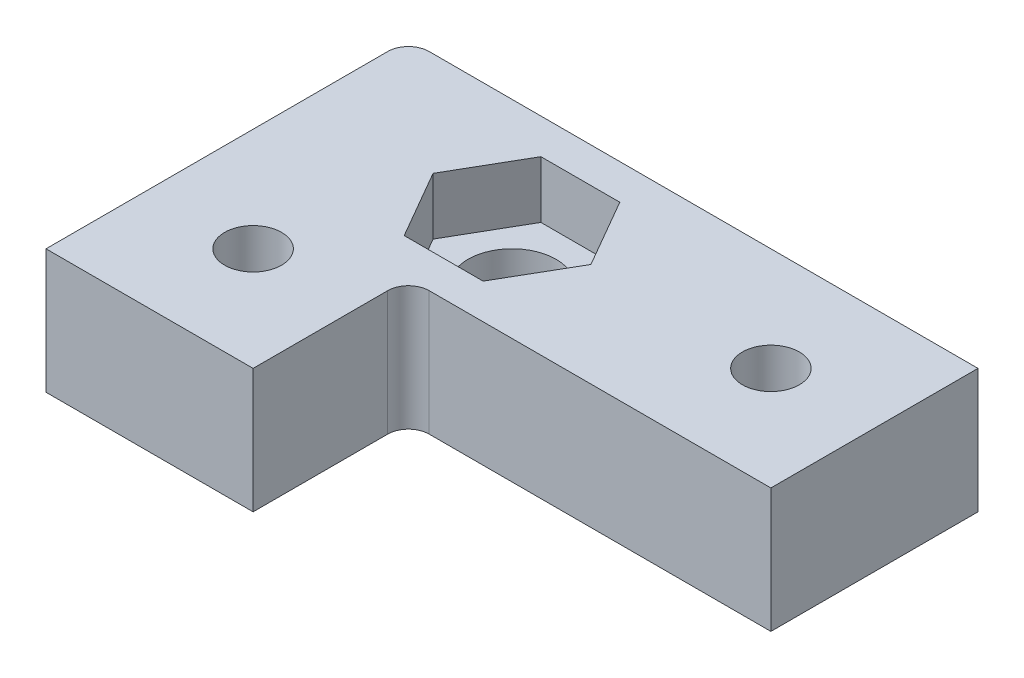
ISO-10303-21;
HEADER;
FILE_DESCRIPTION(('STEP AP214'),'2;1');
FILE_NAME('part.step','',(''),(''),'','','');
FILE_SCHEMA(('AUTOMOTIVE_DESIGN { 1 0 10303 214 1 1 1 1 }'));
ENDSEC;
DATA;
#1=APPLICATION_CONTEXT('core data for automotive mechanical design processes');
#2=APPLICATION_PROTOCOL_DEFINITION('international standard','automotive_design',2000,#1);
#3=PRODUCT_CONTEXT('',#1,'mechanical');
#4=PRODUCT('Part','Part','',(#3));
#5=PRODUCT_RELATED_PRODUCT_CATEGORY('part','',(#4));
#6=PRODUCT_DEFINITION_FORMATION('','',#4);
#7=PRODUCT_DEFINITION_CONTEXT('part definition',#1,'design');
#8=PRODUCT_DEFINITION('design','',#6,#7);
#9=PRODUCT_DEFINITION_SHAPE('','',#8);
#10=(LENGTH_UNIT() NAMED_UNIT(*) SI_UNIT(.MILLI.,.METRE.));
#11=(NAMED_UNIT(*) PLANE_ANGLE_UNIT() SI_UNIT($,.RADIAN.));
#12=(NAMED_UNIT(*) SI_UNIT($,.STERADIAN.) SOLID_ANGLE_UNIT());
#13=UNCERTAINTY_MEASURE_WITH_UNIT(LENGTH_MEASURE(1.E-05),#10,'distance_accuracy_value','');
#14=(GEOMETRIC_REPRESENTATION_CONTEXT(3) GLOBAL_UNCERTAINTY_ASSIGNED_CONTEXT((#13)) GLOBAL_UNIT_ASSIGNED_CONTEXT((#10,
#11,#12)) REPRESENTATION_CONTEXT('',''));
#15=CARTESIAN_POINT('',(0.,0.,0.));
#16=DIRECTION('',(0.,0.,1.));
#17=DIRECTION('',(1.,0.,0.));
#18=AXIS2_PLACEMENT_3D('',#15,#16,#17);
#19=CARTESIAN_POINT('',(0.,12.,0.));
#20=DIRECTION('',(0.,-1.,0.));
#21=DIRECTION('',(0.,0.,1.));
#22=AXIS2_PLACEMENT_3D('',#19,#20,#21);
#23=PLANE('',#22);
#24=CARTESIAN_POINT('',(50.,12.,15.));
#25=DIRECTION('',(0.,-1.,0.));
#26=DIRECTION('',(0.,0.,-1.));
#27=AXIS2_PLACEMENT_3D('',#24,#25,#26);
#28=CIRCLE('',#27,2.75);
#29=CARTESIAN_POINT('',(50.,12.,12.25));
#30=VERTEX_POINT('',#29);
#31=EDGE_CURVE('E271',#30,#30,#28,.T.);
#32=ORIENTED_EDGE('',*,*,#31,.T.);
#33=EDGE_LOOP('',(#32));
#34=FACE_BOUND('',#33,.T.);
#35=CARTESIAN_POINT('',(15.,12.,30.));
#36=DIRECTION('',(0.,-1.,0.));
#37=DIRECTION('',(0.,0.,-1.));
#38=AXIS2_PLACEMENT_3D('',#35,#36,#37);
#39=CIRCLE('',#38,2.75);
#40=CARTESIAN_POINT('',(15.,12.,27.25));
#41=VERTEX_POINT('',#40);
#42=EDGE_CURVE('E265',#41,#41,#39,.T.);
#43=ORIENTED_EDGE('',*,*,#42,.T.);
#44=EDGE_LOOP('',(#43));
#45=FACE_BOUND('',#44,.T.);
#46=DIRECTION('',(-0.5,0.,0.866025403784439));
#47=VECTOR('',#46,1.);
#48=CARTESIAN_POINT('',(32.6210235533031,12.,15.));
#49=LINE('',#48,#47);
#50=CARTESIAN_POINT('',(32.6210235533031,12.,15.));
#51=VERTEX_POINT('',#50);
#52=CARTESIAN_POINT('',(28.8105117766515,12.,21.6));
#53=VERTEX_POINT('',#52);
#54=EDGE_CURVE('E200',#51,#53,#49,.T.);
#55=ORIENTED_EDGE('',*,*,#54,.T.);
#56=DIRECTION('',(-1.,0.,0.));
#57=VECTOR('',#56,1.);
#58=CARTESIAN_POINT('',(28.8105117766515,12.,21.6));
#59=LINE('',#58,#57);
#60=CARTESIAN_POINT('',(21.1894882233485,12.,21.6));
#61=VERTEX_POINT('',#60);
#62=EDGE_CURVE('E203',#53,#61,#59,.T.);
#63=ORIENTED_EDGE('',*,*,#62,.T.);
#64=DIRECTION('',(-0.499999999999999,0.,-0.866025403784439));
#65=VECTOR('',#64,1.);
#66=CARTESIAN_POINT('',(21.1894882233485,12.,21.6));
#67=LINE('',#66,#65);
#68=CARTESIAN_POINT('',(17.3789764466969,12.,15.));
#69=VERTEX_POINT('',#68);
#70=EDGE_CURVE('E206',#61,#69,#67,.T.);
#71=ORIENTED_EDGE('',*,*,#70,.T.);
#72=DIRECTION('',(0.5,0.,-0.866025403784438));
#73=VECTOR('',#72,1.);
#74=CARTESIAN_POINT('',(17.3789764466969,12.,15.));
#75=LINE('',#74,#73);
#76=CARTESIAN_POINT('',(21.1894882233485,12.,8.39999999999999));
#77=VERTEX_POINT('',#76);
#78=EDGE_CURVE('E209',#69,#77,#75,.T.);
#79=ORIENTED_EDGE('',*,*,#78,.T.);
#80=DIRECTION('',(1.,0.,0.));
#81=VECTOR('',#80,1.);
#82=CARTESIAN_POINT('',(21.1894882233485,12.,8.39999999999999));
#83=LINE('',#82,#81);
#84=CARTESIAN_POINT('',(28.8105117766515,12.,8.39999999999999));
#85=VERTEX_POINT('',#84);
#86=EDGE_CURVE('E182',#77,#85,#83,.T.);
#87=ORIENTED_EDGE('',*,*,#86,.T.);
#88=DIRECTION('',(0.499999999999999,0.,0.866025403784439));
#89=VECTOR('',#88,1.);
#90=CARTESIAN_POINT('',(28.8105117766515,12.,8.39999999999999));
#91=LINE('',#90,#89);
#92=EDGE_CURVE('E177',#85,#51,#91,.T.);
#93=ORIENTED_EDGE('',*,*,#92,.T.);
#94=EDGE_LOOP('',(#55,#63,#71,#79,#87,#93));
#95=FACE_BOUND('',#94,.T.);
#96=DIRECTION('',(0.,0.,-1.));
#97=VECTOR('',#96,1.);
#98=CARTESIAN_POINT('',(5.00000000000001,12.,40.));
#99=LINE('',#98,#97);
#100=CARTESIAN_POINT('',(5.00000000000001,12.,40.));
#101=VERTEX_POINT('',#100);
#102=CARTESIAN_POINT('',(5.00000000000001,12.,7.));
#103=VERTEX_POINT('',#102);
#104=EDGE_CURVE('E165',#101,#103,#99,.T.);
#105=ORIENTED_EDGE('',*,*,#104,.F.);
#106=DIRECTION('',(-1.,0.,0.));
#107=VECTOR('',#106,1.);
#108=CARTESIAN_POINT('',(60.,12.,40.));
#109=LINE('',#108,#107);
#110=CARTESIAN_POINT('',(25.,12.,40.));
#111=VERTEX_POINT('',#110);
#112=EDGE_CURVE('E140',#111,#101,#109,.T.);
#113=ORIENTED_EDGE('',*,*,#112,.F.);
#114=DIRECTION('',(0.,0.,1.));
#115=VECTOR('',#114,1.);
#116=CARTESIAN_POINT('',(25.,12.,65.));
#117=LINE('',#116,#115);
#118=CARTESIAN_POINT('',(25.,12.,27.));
#119=VERTEX_POINT('',#118);
#120=EDGE_CURVE('E233',#119,#111,#117,.T.);
#121=ORIENTED_EDGE('',*,*,#120,.F.);
#122=CARTESIAN_POINT('',(27.,12.,27.));
#123=DIRECTION('',(0.,1.,0.));
#124=DIRECTION('',(0.,0.,1.));
#125=AXIS2_PLACEMENT_3D('',#122,#123,#124);
#126=CIRCLE('',#125,2.);
#127=CARTESIAN_POINT('',(27.,12.,25.));
#128=VERTEX_POINT('',#127);
#129=EDGE_CURVE('E248',#128,#119,#126,.T.);
#130=ORIENTED_EDGE('',*,*,#129,.F.);
#131=DIRECTION('',(-1.,0.,0.));
#132=VECTOR('',#131,1.);
#133=CARTESIAN_POINT('',(25.,12.,25.));
#134=LINE('',#133,#132);
#135=CARTESIAN_POINT('',(60.,12.,25.));
#136=VERTEX_POINT('',#135);
#137=EDGE_CURVE('E230',#136,#128,#134,.T.);
#138=ORIENTED_EDGE('',*,*,#137,.F.);
#139=DIRECTION('',(0.,0.,1.));
#140=VECTOR('',#139,1.);
#141=CARTESIAN_POINT('',(60.,12.,5.));
#142=LINE('',#141,#140);
#143=CARTESIAN_POINT('',(60.,12.,5.));
#144=VERTEX_POINT('',#143);
#145=EDGE_CURVE('E170',#144,#136,#142,.T.);
#146=ORIENTED_EDGE('',*,*,#145,.F.);
#147=DIRECTION('',(1.,0.,0.));
#148=VECTOR('',#147,1.);
#149=CARTESIAN_POINT('',(5.00000000000001,12.,5.));
#150=LINE('',#149,#148);
#151=CARTESIAN_POINT('',(7.00000000000001,12.,5.));
#152=VERTEX_POINT('',#151);
#153=EDGE_CURVE('E167',#152,#144,#150,.T.);
#154=ORIENTED_EDGE('',*,*,#153,.F.);
#155=CARTESIAN_POINT('',(7.00000000000001,12.,7.));
#156=DIRECTION('',(0.,1.,0.));
#157=DIRECTION('',(0.,0.,1.));
#158=AXIS2_PLACEMENT_3D('',#155,#156,#157);
#159=CIRCLE('',#158,2.);
#160=EDGE_CURVE('E252',#103,#152,#159,.F.);
#161=ORIENTED_EDGE('',*,*,#160,.F.);
#162=EDGE_LOOP('',(#105,#113,#121,#130,#138,#146,#154,#161));
#163=FACE_BOUND('',#162,.T.);
#164=ADVANCED_FACE('F35',(#34,#45,#95,#163),#23,.F.);
#165=CARTESIAN_POINT('',(25.,12.,25.));
#166=DIRECTION('',(0.,0.,-1.));
#167=DIRECTION('',(1.,0.,0.));
#168=AXIS2_PLACEMENT_3D('',#165,#166,#167);
#169=PLANE('',#168);
#170=DIRECTION('',(0.,1.,0.));
#171=VECTOR('',#170,1.);
#172=CARTESIAN_POINT('',(60.,12.,25.));
#173=LINE('',#172,#171);
#174=CARTESIAN_POINT('',(60.,0.,25.));
#175=VERTEX_POINT('',#174);
#176=EDGE_CURVE('E144',#175,#136,#173,.T.);
#177=ORIENTED_EDGE('',*,*,#176,.T.);
#178=ORIENTED_EDGE('',*,*,#137,.T.);
#179=DIRECTION('',(0.,-1.,0.));
#180=VECTOR('',#179,1.);
#181=CARTESIAN_POINT('',(27.,12.,25.));
#182=LINE('',#181,#180);
#183=CARTESIAN_POINT('',(27.,0.,25.));
#184=VERTEX_POINT('',#183);
#185=EDGE_CURVE('E244',#184,#128,#182,.F.);
#186=ORIENTED_EDGE('',*,*,#185,.F.);
#187=DIRECTION('',(-1.,0.,0.));
#188=VECTOR('',#187,1.);
#189=CARTESIAN_POINT('',(25.,0.,25.));
#190=LINE('',#189,#188);
#191=EDGE_CURVE('E229',#175,#184,#190,.T.);
#192=ORIENTED_EDGE('',*,*,#191,.F.);
#193=EDGE_LOOP('',(#177,#178,#186,#192));
#194=FACE_BOUND('',#193,.T.);
#195=ADVANCED_FACE('F309',(#194),#169,.F.);
#196=CARTESIAN_POINT('',(25.,12.,65.));
#197=DIRECTION('',(-1.,0.,0.));
#198=DIRECTION('',(0.,0.,-1.));
#199=AXIS2_PLACEMENT_3D('',#196,#197,#198);
#200=PLANE('',#199);
#201=DIRECTION('',(0.,-1.,0.));
#202=VECTOR('',#201,1.);
#203=CARTESIAN_POINT('',(25.,12.,40.));
#204=LINE('',#203,#202);
#205=CARTESIAN_POINT('',(25.,0.,40.));
#206=VERTEX_POINT('',#205);
#207=EDGE_CURVE('E175',#111,#206,#204,.T.);
#208=ORIENTED_EDGE('',*,*,#207,.T.);
#209=DIRECTION('',(0.,0.,1.));
#210=VECTOR('',#209,1.);
#211=CARTESIAN_POINT('',(25.,0.,65.));
#212=LINE('',#211,#210);
#213=CARTESIAN_POINT('',(25.,0.,27.));
#214=VERTEX_POINT('',#213);
#215=EDGE_CURVE('E157',#214,#206,#212,.T.);
#216=ORIENTED_EDGE('',*,*,#215,.F.);
#217=DIRECTION('',(0.,-1.,0.));
#218=VECTOR('',#217,1.);
#219=CARTESIAN_POINT('',(25.,0.,27.));
#220=LINE('',#219,#218);
#221=EDGE_CURVE('E236',#119,#214,#220,.T.);
#222=ORIENTED_EDGE('',*,*,#221,.F.);
#223=ORIENTED_EDGE('',*,*,#120,.T.);
#224=EDGE_LOOP('',(#208,#216,#222,#223));
#225=FACE_BOUND('',#224,.T.);
#226=ADVANCED_FACE('F283',(#225),#200,.F.);
#227=CARTESIAN_POINT('',(0.,0.,0.));
#228=DIRECTION('',(0.,-1.,0.));
#229=DIRECTION('',(0.,0.,1.));
#230=AXIS2_PLACEMENT_3D('',#227,#228,#229);
#231=PLANE('',#230);
#232=CARTESIAN_POINT('',(50.,0.,15.));
#233=DIRECTION('',(0.,-1.,0.));
#234=DIRECTION('',(0.,0.,-1.));
#235=AXIS2_PLACEMENT_3D('',#232,#233,#234);
#236=CIRCLE('',#235,2.75);
#237=CARTESIAN_POINT('',(50.,0.,12.25));
#238=VERTEX_POINT('',#237);
#239=EDGE_CURVE('E268',#238,#238,#236,.T.);
#240=ORIENTED_EDGE('',*,*,#239,.F.);
#241=EDGE_LOOP('',(#240));
#242=FACE_BOUND('',#241,.T.);
#243=CARTESIAN_POINT('',(15.,0.,30.));
#244=DIRECTION('',(0.,-1.,0.));
#245=DIRECTION('',(0.,0.,-1.));
#246=AXIS2_PLACEMENT_3D('',#243,#244,#245);
#247=CIRCLE('',#246,2.75);
#248=CARTESIAN_POINT('',(15.,0.,27.25));
#249=VERTEX_POINT('',#248);
#250=EDGE_CURVE('E168',#249,#249,#247,.T.);
#251=ORIENTED_EDGE('',*,*,#250,.F.);
#252=EDGE_LOOP('',(#251));
#253=FACE_BOUND('',#252,.T.);
#254=CARTESIAN_POINT('',(25.,0.,15.));
#255=DIRECTION('',(0.,-1.,0.));
#256=DIRECTION('',(0.,0.,-1.));
#257=AXIS2_PLACEMENT_3D('',#254,#255,#256);
#258=CIRCLE('',#257,4.25);
#259=CARTESIAN_POINT('',(25.,0.,10.75));
#260=VERTEX_POINT('',#259);
#261=EDGE_CURVE('E226',#260,#260,#258,.T.);
#262=ORIENTED_EDGE('',*,*,#261,.F.);
#263=EDGE_LOOP('',(#262));
#264=FACE_BOUND('',#263,.T.);
#265=DIRECTION('',(1.,0.,0.));
#266=VECTOR('',#265,1.);
#267=CARTESIAN_POINT('',(5.00000000000001,0.,5.));
#268=LINE('',#267,#266);
#269=CARTESIAN_POINT('',(7.00000000000001,0.,5.));
#270=VERTEX_POINT('',#269);
#271=CARTESIAN_POINT('',(60.,0.,5.));
#272=VERTEX_POINT('',#271);
#273=EDGE_CURVE('E152',#270,#272,#268,.T.);
#274=ORIENTED_EDGE('',*,*,#273,.T.);
#275=DIRECTION('',(0.,0.,1.));
#276=VECTOR('',#275,1.);
#277=CARTESIAN_POINT('',(60.,0.,5.));
#278=LINE('',#277,#276);
#279=EDGE_CURVE('E159',#272,#175,#278,.T.);
#280=ORIENTED_EDGE('',*,*,#279,.T.);
#281=ORIENTED_EDGE('',*,*,#191,.T.);
#282=CARTESIAN_POINT('',(27.,0.,27.));
#283=DIRECTION('',(0.,1.,0.));
#284=DIRECTION('',(0.,0.,1.));
#285=AXIS2_PLACEMENT_3D('',#282,#283,#284);
#286=CIRCLE('',#285,2.);
#287=EDGE_CURVE('E246',#214,#184,#286,.F.);
#288=ORIENTED_EDGE('',*,*,#287,.F.);
#289=ORIENTED_EDGE('',*,*,#215,.T.);
#290=DIRECTION('',(-1.,0.,0.));
#291=VECTOR('',#290,1.);
#292=CARTESIAN_POINT('',(60.,0.,40.));
#293=LINE('',#292,#291);
#294=CARTESIAN_POINT('',(5.00000000000001,0.,40.));
#295=VERTEX_POINT('',#294);
#296=EDGE_CURVE('E137',#206,#295,#293,.T.);
#297=ORIENTED_EDGE('',*,*,#296,.T.);
#298=DIRECTION('',(0.,0.,-1.));
#299=VECTOR('',#298,1.);
#300=CARTESIAN_POINT('',(5.00000000000001,0.,40.));
#301=LINE('',#300,#299);
#302=CARTESIAN_POINT('',(5.00000000000001,0.,7.));
#303=VERTEX_POINT('',#302);
#304=EDGE_CURVE('E148',#295,#303,#301,.T.);
#305=ORIENTED_EDGE('',*,*,#304,.T.);
#306=CARTESIAN_POINT('',(7.00000000000001,0.,7.));
#307=DIRECTION('',(0.,1.,0.));
#308=DIRECTION('',(0.,0.,1.));
#309=AXIS2_PLACEMENT_3D('',#306,#307,#308);
#310=CIRCLE('',#309,2.);
#311=EDGE_CURVE('E11',#270,#303,#310,.T.);
#312=ORIENTED_EDGE('',*,*,#311,.F.);
#313=EDGE_LOOP('',(#274,#280,#281,#288,#289,#297,#305,#312));
#314=FACE_BOUND('',#313,.T.);
#315=ADVANCED_FACE('F155',(#242,#253,#264,#314),#231,.T.);
#316=CARTESIAN_POINT('',(25.,0.,15.));
#317=DIRECTION('',(0.,1.,0.));
#318=DIRECTION('',(0.,0.,-1.));
#319=AXIS2_PLACEMENT_3D('',#316,#317,#318);
#320=CYLINDRICAL_SURFACE('',#319,4.25);
#321=ORIENTED_EDGE('',*,*,#261,.T.);
#322=EDGE_LOOP('',(#321));
#323=FACE_BOUND('',#322,.T.);
#324=CARTESIAN_POINT('',(25.,6.5,15.));
#325=DIRECTION('',(0.,-1.,0.));
#326=DIRECTION('',(0.,0.,-1.));
#327=AXIS2_PLACEMENT_3D('',#324,#325,#326);
#328=CIRCLE('',#327,4.25);
#329=CARTESIAN_POINT('',(25.,6.5,10.75));
#330=VERTEX_POINT('',#329);
#331=EDGE_CURVE('E216',#330,#330,#328,.F.);
#332=ORIENTED_EDGE('',*,*,#331,.T.);
#333=EDGE_LOOP('',(#332));
#334=FACE_BOUND('',#333,.T.);
#335=ADVANCED_FACE('F282',(#323,#334),#320,.F.);
#336=CARTESIAN_POINT('',(0.,6.5,0.));
#337=DIRECTION('',(0.,1.,0.));
#338=DIRECTION('',(0.,0.,-1.));
#339=AXIS2_PLACEMENT_3D('',#336,#337,#338);
#340=PLANE('',#339);
#341=DIRECTION('',(0.499999999999999,0.,0.866025403784439));
#342=VECTOR('',#341,1.);
#343=CARTESIAN_POINT('',(28.8105117766515,6.5,8.39999999999999));
#344=LINE('',#343,#342);
#345=CARTESIAN_POINT('',(28.8105117766515,6.5,8.39999999999999));
#346=VERTEX_POINT('',#345);
#347=CARTESIAN_POINT('',(32.6210235533031,6.5,15.));
#348=VERTEX_POINT('',#347);
#349=EDGE_CURVE('E178',#346,#348,#344,.T.);
#350=ORIENTED_EDGE('',*,*,#349,.F.);
#351=DIRECTION('',(1.,0.,0.));
#352=VECTOR('',#351,1.);
#353=CARTESIAN_POINT('',(21.1894882233485,6.5,8.39999999999999));
#354=LINE('',#353,#352);
#355=CARTESIAN_POINT('',(21.1894882233485,6.5,8.39999999999999));
#356=VERTEX_POINT('',#355);
#357=EDGE_CURVE('E194',#356,#346,#354,.T.);
#358=ORIENTED_EDGE('',*,*,#357,.F.);
#359=DIRECTION('',(0.5,0.,-0.866025403784438));
#360=VECTOR('',#359,1.);
#361=CARTESIAN_POINT('',(17.3789764466969,6.5,15.));
#362=LINE('',#361,#360);
#363=CARTESIAN_POINT('',(17.3789764466969,6.5,15.));
#364=VERTEX_POINT('',#363);
#365=EDGE_CURVE('E191',#364,#356,#362,.T.);
#366=ORIENTED_EDGE('',*,*,#365,.F.);
#367=DIRECTION('',(-0.499999999999999,0.,-0.866025403784439));
#368=VECTOR('',#367,1.);
#369=CARTESIAN_POINT('',(21.1894882233485,6.5,21.6));
#370=LINE('',#369,#368);
#371=CARTESIAN_POINT('',(21.1894882233485,6.5,21.6));
#372=VERTEX_POINT('',#371);
#373=EDGE_CURVE('E188',#372,#364,#370,.T.);
#374=ORIENTED_EDGE('',*,*,#373,.F.);
#375=DIRECTION('',(-1.,0.,0.));
#376=VECTOR('',#375,1.);
#377=CARTESIAN_POINT('',(28.8105117766515,6.5,21.6));
#378=LINE('',#377,#376);
#379=CARTESIAN_POINT('',(28.8105117766515,6.5,21.6));
#380=VERTEX_POINT('',#379);
#381=EDGE_CURVE('E185',#380,#372,#378,.T.);
#382=ORIENTED_EDGE('',*,*,#381,.F.);
#383=DIRECTION('',(-0.5,0.,0.866025403784439));
#384=VECTOR('',#383,1.);
#385=CARTESIAN_POINT('',(32.6210235533031,6.5,15.));
#386=LINE('',#385,#384);
#387=EDGE_CURVE('E181',#348,#380,#386,.T.);
#388=ORIENTED_EDGE('',*,*,#387,.F.);
#389=EDGE_LOOP('',(#350,#358,#366,#374,#382,#388));
#390=FACE_BOUND('',#389,.T.);
#391=ORIENTED_EDGE('',*,*,#331,.F.);
#392=EDGE_LOOP('',(#391));
#393=FACE_BOUND('',#392,.T.);
#394=ADVANCED_FACE('F291',(#390,#393),#340,.T.);
#395=CARTESIAN_POINT('',(28.8105117766515,6.5,8.39999999999999));
#396=DIRECTION('',(0.866025403784439,0.,-0.499999999999999));
#397=DIRECTION('',(0.499999999999999,0.,0.866025403784439));
#398=AXIS2_PLACEMENT_3D('',#395,#396,#397);
#399=PLANE('',#398);
#400=ORIENTED_EDGE('',*,*,#92,.F.);
#401=DIRECTION('',(0.,1.,0.));
#402=VECTOR('',#401,1.);
#403=CARTESIAN_POINT('',(28.8105117766515,6.5,8.39999999999999));
#404=LINE('',#403,#402);
#405=EDGE_CURVE('E214',#346,#85,#404,.T.);
#406=ORIENTED_EDGE('',*,*,#405,.F.);
#407=ORIENTED_EDGE('',*,*,#349,.T.);
#408=DIRECTION('',(0.,1.,0.));
#409=VECTOR('',#408,1.);
#410=CARTESIAN_POINT('',(32.6210235533031,6.5,15.));
#411=LINE('',#410,#409);
#412=EDGE_CURVE('E197',#348,#51,#411,.T.);
#413=ORIENTED_EDGE('',*,*,#412,.T.);
#414=EDGE_LOOP('',(#400,#406,#407,#413));
#415=FACE_BOUND('',#414,.T.);
#416=ADVANCED_FACE('F296',(#415),#399,.F.);
#417=CARTESIAN_POINT('',(21.1894882233485,6.5,8.39999999999999));
#418=DIRECTION('',(0.,0.,-1.));
#419=DIRECTION('',(1.,0.,0.));
#420=AXIS2_PLACEMENT_3D('',#417,#418,#419);
#421=PLANE('',#420);
#422=ORIENTED_EDGE('',*,*,#86,.F.);
#423=DIRECTION('',(0.,1.,0.));
#424=VECTOR('',#423,1.);
#425=CARTESIAN_POINT('',(21.1894882233485,6.5,8.39999999999999));
#426=LINE('',#425,#424);
#427=EDGE_CURVE('E217',#356,#77,#426,.T.);
#428=ORIENTED_EDGE('',*,*,#427,.F.);
#429=ORIENTED_EDGE('',*,*,#357,.T.);
#430=ORIENTED_EDGE('',*,*,#405,.T.);
#431=EDGE_LOOP('',(#422,#428,#429,#430));
#432=FACE_BOUND('',#431,.T.);
#433=ADVANCED_FACE('F302',(#432),#421,.F.);
#434=CARTESIAN_POINT('',(17.3789764466969,6.5,15.));
#435=DIRECTION('',(-0.866025403784438,0.,-0.5));
#436=DIRECTION('',(0.5,0.,-0.866025403784438));
#437=AXIS2_PLACEMENT_3D('',#434,#435,#436);
#438=PLANE('',#437);
#439=ORIENTED_EDGE('',*,*,#78,.F.);
#440=DIRECTION('',(0.,1.,0.));
#441=VECTOR('',#440,1.);
#442=CARTESIAN_POINT('',(17.3789764466969,6.5,15.));
#443=LINE('',#442,#441);
#444=EDGE_CURVE('E219',#364,#69,#443,.T.);
#445=ORIENTED_EDGE('',*,*,#444,.F.);
#446=ORIENTED_EDGE('',*,*,#365,.T.);
#447=ORIENTED_EDGE('',*,*,#427,.T.);
#448=EDGE_LOOP('',(#439,#445,#446,#447));
#449=FACE_BOUND('',#448,.T.);
#450=ADVANCED_FACE('F346',(#449),#438,.F.);
#451=CARTESIAN_POINT('',(21.1894882233485,6.5,21.6));
#452=DIRECTION('',(-0.866025403784439,0.,0.499999999999999));
#453=DIRECTION('',(-0.499999999999999,0.,-0.866025403784439));
#454=AXIS2_PLACEMENT_3D('',#451,#452,#453);
#455=PLANE('',#454);
#456=ORIENTED_EDGE('',*,*,#70,.F.);
#457=DIRECTION('',(0.,1.,0.));
#458=VECTOR('',#457,1.);
#459=CARTESIAN_POINT('',(21.1894882233485,6.5,21.6));
#460=LINE('',#459,#458);
#461=EDGE_CURVE('E221',#372,#61,#460,.T.);
#462=ORIENTED_EDGE('',*,*,#461,.F.);
#463=ORIENTED_EDGE('',*,*,#373,.T.);
#464=ORIENTED_EDGE('',*,*,#444,.T.);
#465=EDGE_LOOP('',(#456,#462,#463,#464));
#466=FACE_BOUND('',#465,.T.);
#467=ADVANCED_FACE('F339',(#466),#455,.F.);
#468=CARTESIAN_POINT('',(28.8105117766515,6.5,21.6));
#469=DIRECTION('',(0.,0.,1.));
#470=DIRECTION('',(-1.,0.,0.));
#471=AXIS2_PLACEMENT_3D('',#468,#469,#470);
#472=PLANE('',#471);
#473=ORIENTED_EDGE('',*,*,#62,.F.);
#474=DIRECTION('',(0.,1.,0.));
#475=VECTOR('',#474,1.);
#476=CARTESIAN_POINT('',(28.8105117766515,6.5,21.6));
#477=LINE('',#476,#475);
#478=EDGE_CURVE('E223',#380,#53,#477,.T.);
#479=ORIENTED_EDGE('',*,*,#478,.F.);
#480=ORIENTED_EDGE('',*,*,#381,.T.);
#481=ORIENTED_EDGE('',*,*,#461,.T.);
#482=EDGE_LOOP('',(#473,#479,#480,#481));
#483=FACE_BOUND('',#482,.T.);
#484=ADVANCED_FACE('F330',(#483),#472,.F.);
#485=CARTESIAN_POINT('',(32.6210235533031,6.5,15.));
#486=DIRECTION('',(0.866025403784438,0.,0.5));
#487=DIRECTION('',(-0.5,0.,0.866025403784439));
#488=AXIS2_PLACEMENT_3D('',#485,#486,#487);
#489=PLANE('',#488);
#490=ORIENTED_EDGE('',*,*,#54,.F.);
#491=ORIENTED_EDGE('',*,*,#412,.F.);
#492=ORIENTED_EDGE('',*,*,#387,.T.);
#493=ORIENTED_EDGE('',*,*,#478,.T.);
#494=EDGE_LOOP('',(#490,#491,#492,#493));
#495=FACE_BOUND('',#494,.T.);
#496=ADVANCED_FACE('F323',(#495),#489,.F.);
#497=CARTESIAN_POINT('',(27.,12.,27.));
#498=DIRECTION('',(0.,1.,0.));
#499=DIRECTION('',(0.,0.,-1.));
#500=AXIS2_PLACEMENT_3D('',#497,#498,#499);
#501=CYLINDRICAL_SURFACE('',#500,2.);
#502=ORIENTED_EDGE('',*,*,#129,.T.);
#503=ORIENTED_EDGE('',*,*,#221,.T.);
#504=ORIENTED_EDGE('',*,*,#287,.T.);
#505=ORIENTED_EDGE('',*,*,#185,.T.);
#506=EDGE_LOOP('',(#502,#503,#504,#505));
#507=FACE_BOUND('',#506,.T.);
#508=ADVANCED_FACE('F321',(#507),#501,.F.);
#509=CARTESIAN_POINT('',(60.,0.,40.));
#510=DIRECTION('',(0.,0.,1.));
#511=DIRECTION('',(-1.,0.,0.));
#512=AXIS2_PLACEMENT_3D('',#509,#510,#511);
#513=PLANE('',#512);
#514=ORIENTED_EDGE('',*,*,#207,.F.);
#515=ORIENTED_EDGE('',*,*,#112,.T.);
#516=DIRECTION('',(0.,1.,0.));
#517=VECTOR('',#516,1.);
#518=CARTESIAN_POINT('',(5.00000000000001,0.,40.));
#519=LINE('',#518,#517);
#520=EDGE_CURVE('E133',#295,#101,#519,.T.);
#521=ORIENTED_EDGE('',*,*,#520,.F.);
#522=ORIENTED_EDGE('',*,*,#296,.F.);
#523=EDGE_LOOP('',(#514,#515,#521,#522));
#524=FACE_BOUND('',#523,.T.);
#525=ADVANCED_FACE('F135',(#524),#513,.T.);
#526=CARTESIAN_POINT('',(60.,0.,5.));
#527=DIRECTION('',(1.,0.,0.));
#528=DIRECTION('',(0.,0.,1.));
#529=AXIS2_PLACEMENT_3D('',#526,#527,#528);
#530=PLANE('',#529);
#531=ORIENTED_EDGE('',*,*,#176,.F.);
#532=ORIENTED_EDGE('',*,*,#279,.F.);
#533=DIRECTION('',(0.,1.,0.));
#534=VECTOR('',#533,1.);
#535=CARTESIAN_POINT('',(60.,0.,5.));
#536=LINE('',#535,#534);
#537=EDGE_CURVE('E145',#272,#144,#536,.T.);
#538=ORIENTED_EDGE('',*,*,#537,.T.);
#539=ORIENTED_EDGE('',*,*,#145,.T.);
#540=EDGE_LOOP('',(#531,#532,#538,#539));
#541=FACE_BOUND('',#540,.T.);
#542=ADVANCED_FACE('F262',(#541),#530,.T.);
#543=CARTESIAN_POINT('',(5.00000000000001,0.,40.));
#544=DIRECTION('',(-1.,0.,0.));
#545=DIRECTION('',(0.,0.,-1.));
#546=AXIS2_PLACEMENT_3D('',#543,#544,#545);
#547=PLANE('',#546);
#548=ORIENTED_EDGE('',*,*,#304,.F.);
#549=ORIENTED_EDGE('',*,*,#520,.T.);
#550=ORIENTED_EDGE('',*,*,#104,.T.);
#551=DIRECTION('',(0.,1.,0.));
#552=VECTOR('',#551,1.);
#553=CARTESIAN_POINT('',(5.00000000000001,0.,7.));
#554=LINE('',#553,#552);
#555=EDGE_CURVE('E150',#303,#103,#554,.T.);
#556=ORIENTED_EDGE('',*,*,#555,.F.);
#557=EDGE_LOOP('',(#548,#549,#550,#556));
#558=FACE_BOUND('',#557,.T.);
#559=ADVANCED_FACE('F149',(#558),#547,.T.);
#560=CARTESIAN_POINT('',(5.00000000000001,0.,5.));
#561=DIRECTION('',(0.,0.,-1.));
#562=DIRECTION('',(1.,0.,0.));
#563=AXIS2_PLACEMENT_3D('',#560,#561,#562);
#564=PLANE('',#563);
#565=ORIENTED_EDGE('',*,*,#153,.T.);
#566=ORIENTED_EDGE('',*,*,#537,.F.);
#567=ORIENTED_EDGE('',*,*,#273,.F.);
#568=DIRECTION('',(0.,1.,0.));
#569=VECTOR('',#568,1.);
#570=CARTESIAN_POINT('',(7.00000000000001,0.,5.));
#571=LINE('',#570,#569);
#572=EDGE_CURVE('E43',#152,#270,#571,.F.);
#573=ORIENTED_EDGE('',*,*,#572,.F.);
#574=EDGE_LOOP('',(#565,#566,#567,#573));
#575=FACE_BOUND('',#574,.T.);
#576=ADVANCED_FACE('F258',(#575),#564,.T.);
#577=CARTESIAN_POINT('',(7.00000000000001,0.,7.));
#578=DIRECTION('',(0.,1.,0.));
#579=DIRECTION('',(0.,0.,-1.));
#580=AXIS2_PLACEMENT_3D('',#577,#578,#579);
#581=CYLINDRICAL_SURFACE('',#580,2.);
#582=ORIENTED_EDGE('',*,*,#311,.T.);
#583=ORIENTED_EDGE('',*,*,#555,.T.);
#584=ORIENTED_EDGE('',*,*,#160,.T.);
#585=ORIENTED_EDGE('',*,*,#572,.T.);
#586=EDGE_LOOP('',(#582,#583,#584,#585));
#587=FACE_BOUND('',#586,.T.);
#588=ADVANCED_FACE('F37',(#587),#581,.T.);
#589=CARTESIAN_POINT('',(15.,0.,30.));
#590=DIRECTION('',(0.,1.,0.));
#591=DIRECTION('',(0.,0.,-1.));
#592=AXIS2_PLACEMENT_3D('',#589,#590,#591);
#593=CYLINDRICAL_SURFACE('',#592,2.75);
#594=ORIENTED_EDGE('',*,*,#250,.T.);
#595=EDGE_LOOP('',(#594));
#596=FACE_BOUND('',#595,.T.);
#597=ORIENTED_EDGE('',*,*,#42,.F.);
#598=EDGE_LOOP('',(#597));
#599=FACE_BOUND('',#598,.T.);
#600=ADVANCED_FACE('F425',(#596,#599),#593,.F.);
#601=CARTESIAN_POINT('',(50.,0.,15.));
#602=DIRECTION('',(0.,1.,0.));
#603=DIRECTION('',(0.,0.,-1.));
#604=AXIS2_PLACEMENT_3D('',#601,#602,#603);
#605=CYLINDRICAL_SURFACE('',#604,2.75);
#606=ORIENTED_EDGE('',*,*,#239,.T.);
#607=EDGE_LOOP('',(#606));
#608=FACE_BOUND('',#607,.T.);
#609=ORIENTED_EDGE('',*,*,#31,.F.);
#610=EDGE_LOOP('',(#609));
#611=FACE_BOUND('',#610,.T.);
#612=ADVANCED_FACE('F277',(#608,#611),#605,.F.);
#613=CLOSED_SHELL('',(#164,#195,#226,#315,#335,#394,#416,#433,#450,#467,#484,#496,#508,#525,
#542,#559,#576,#588,#600,#612));
#614=MANIFOLD_SOLID_BREP('B2',#613);
#615=ADVANCED_BREP_SHAPE_REPRESENTATION('',(#18,#614),#14);
#616=SHAPE_DEFINITION_REPRESENTATION(#9,#615);
ENDSEC;
END-ISO-10303-21;
